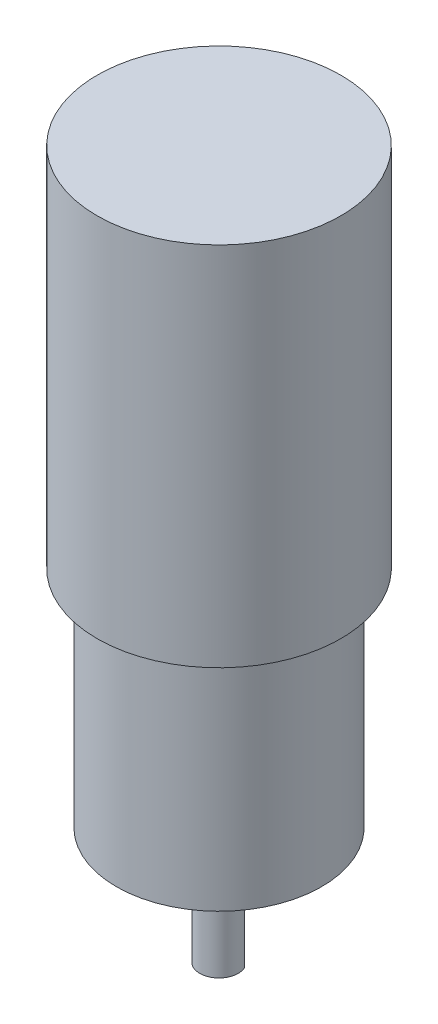
ISO-10303-21;
HEADER;
FILE_DESCRIPTION(('STEP AP214'),'2;1');
FILE_NAME('part.step','',(''),(''),'','','');
FILE_SCHEMA(('AUTOMOTIVE_DESIGN { 1 0 10303 214 1 1 1 1 }'));
ENDSEC;
DATA;
#1=APPLICATION_CONTEXT('core data for automotive mechanical design processes');
#2=APPLICATION_PROTOCOL_DEFINITION('international standard','automotive_design',2000,#1);
#3=PRODUCT_CONTEXT('',#1,'mechanical');
#4=PRODUCT('Part','Part','',(#3));
#5=PRODUCT_RELATED_PRODUCT_CATEGORY('part','',(#4));
#6=PRODUCT_DEFINITION_FORMATION('','',#4);
#7=PRODUCT_DEFINITION_CONTEXT('part definition',#1,'design');
#8=PRODUCT_DEFINITION('design','',#6,#7);
#9=PRODUCT_DEFINITION_SHAPE('','',#8);
#10=(LENGTH_UNIT() NAMED_UNIT(*) SI_UNIT(.MILLI.,.METRE.));
#11=(NAMED_UNIT(*) PLANE_ANGLE_UNIT() SI_UNIT($,.RADIAN.));
#12=(NAMED_UNIT(*) SI_UNIT($,.STERADIAN.) SOLID_ANGLE_UNIT());
#13=UNCERTAINTY_MEASURE_WITH_UNIT(LENGTH_MEASURE(1.E-05),#10,'distance_accuracy_value','');
#14=(GEOMETRIC_REPRESENTATION_CONTEXT(3) GLOBAL_UNCERTAINTY_ASSIGNED_CONTEXT((#13)) GLOBAL_UNIT_ASSIGNED_CONTEXT((#10,
#11,#12)) REPRESENTATION_CONTEXT('',''));
#15=CARTESIAN_POINT('',(0.,0.,0.));
#16=DIRECTION('',(0.,0.,1.));
#17=DIRECTION('',(1.,0.,0.));
#18=AXIS2_PLACEMENT_3D('',#15,#16,#17);
#19=CARTESIAN_POINT('',(0.,12.,-1.19895788082818));
#20=DIRECTION('',(0.,0.,-1.));
#21=DIRECTION('',(-1.,0.,0.));
#22=AXIS2_PLACEMENT_3D('',#19,#20,#21);
#23=PLANE('',#22);
#24=DIRECTION('',(1.,0.,0.));
#25=VECTOR('',#24,1.);
#26=CARTESIAN_POINT('',(0.,0.,-1.19895788082818));
#27=LINE('',#26,#25);
#28=CARTESIAN_POINT('',(-2.75,0.,-1.19895788082818));
#29=VERTEX_POINT('',#28);
#30=CARTESIAN_POINT('',(2.75,0.,-1.19895788082818));
#31=VERTEX_POINT('',#30);
#32=EDGE_CURVE('E141',#29,#31,#27,.T.);
#33=ORIENTED_EDGE('',*,*,#32,.F.);
#34=DIRECTION('',(0.,-1.,0.));
#35=VECTOR('',#34,1.);
#36=CARTESIAN_POINT('',(-2.75,12.,-1.19895788082818));
#37=LINE('',#36,#35);
#38=CARTESIAN_POINT('',(-2.75,12.,-1.19895788082818));
#39=VERTEX_POINT('',#38);
#40=EDGE_CURVE('E11',#39,#29,#37,.T.);
#41=ORIENTED_EDGE('',*,*,#40,.F.);
#42=DIRECTION('',(1.,0.,0.));
#43=VECTOR('',#42,1.);
#44=CARTESIAN_POINT('',(0.,12.,-1.19895788082818));
#45=LINE('',#44,#43);
#46=CARTESIAN_POINT('',(2.75,12.,-1.19895788082818));
#47=VERTEX_POINT('',#46);
#48=EDGE_CURVE('E66',#39,#47,#45,.T.);
#49=ORIENTED_EDGE('',*,*,#48,.T.);
#50=DIRECTION('',(0.,-1.,0.));
#51=VECTOR('',#50,1.);
#52=CARTESIAN_POINT('',(2.75,12.,-1.19895788082818));
#53=LINE('',#52,#51);
#54=EDGE_CURVE('E47',#47,#31,#53,.T.);
#55=ORIENTED_EDGE('',*,*,#54,.T.);
#56=EDGE_LOOP('',(#33,#41,#49,#55));
#57=FACE_BOUND('',#56,.T.);
#58=ADVANCED_FACE('F39',(#57),#23,.T.);
#59=CARTESIAN_POINT('',(0.,12.,0.));
#60=DIRECTION('',(0.,-1.,0.));
#61=DIRECTION('',(0.,0.,-1.));
#62=AXIS2_PLACEMENT_3D('',#59,#60,#61);
#63=CYLINDRICAL_SURFACE('',#62,3.);
#64=CARTESIAN_POINT('',(0.,0.,0.));
#65=DIRECTION('',(0.,1.,0.));
#66=DIRECTION('',(0.,0.,1.));
#67=AXIS2_PLACEMENT_3D('',#64,#65,#66);
#68=CIRCLE('',#67,3.);
#69=EDGE_CURVE('E144',#29,#31,#68,.T.);
#70=ORIENTED_EDGE('',*,*,#69,.T.);
#71=ORIENTED_EDGE('',*,*,#54,.F.);
#72=CARTESIAN_POINT('',(0.,12.,0.));
#73=DIRECTION('',(0.,1.,0.));
#74=DIRECTION('',(0.,0.,1.));
#75=AXIS2_PLACEMENT_3D('',#72,#73,#74);
#76=CIRCLE('',#75,3.);
#77=EDGE_CURVE('E53',#47,#39,#76,.T.);
#78=ORIENTED_EDGE('',*,*,#77,.T.);
#79=ORIENTED_EDGE('',*,*,#40,.T.);
#80=EDGE_LOOP('',(#70,#71,#78,#79));
#81=FACE_BOUND('',#80,.T.);
#82=CARTESIAN_POINT('',(0.,15.2,0.));
#83=DIRECTION('',(0.,1.,0.));
#84=DIRECTION('',(0.,0.,1.));
#85=AXIS2_PLACEMENT_3D('',#82,#83,#84);
#86=CIRCLE('',#85,3.);
#87=CARTESIAN_POINT('',(0.,15.2,3.));
#88=VERTEX_POINT('',#87);
#89=EDGE_CURVE('E138',#88,#88,#86,.T.);
#90=ORIENTED_EDGE('',*,*,#89,.F.);
#91=EDGE_LOOP('',(#90));
#92=FACE_BOUND('',#91,.T.);
#93=ADVANCED_FACE('F149',(#81,#92),#63,.T.);
#94=CARTESIAN_POINT('',(0.,0.,0.));
#95=DIRECTION('',(0.,1.,0.));
#96=DIRECTION('',(0.,0.,1.));
#97=AXIS2_PLACEMENT_3D('',#94,#95,#96);
#98=PLANE('',#97);
#99=ORIENTED_EDGE('',*,*,#32,.T.);
#100=ORIENTED_EDGE('',*,*,#69,.F.);
#101=EDGE_LOOP('',(#99,#100));
#102=FACE_BOUND('',#101,.T.);
#103=ADVANCED_FACE('F152',(#102),#98,.F.);
#104=CARTESIAN_POINT('',(0.,12.,0.));
#105=DIRECTION('',(0.,1.,0.));
#106=DIRECTION('',(0.,0.,1.));
#107=AXIS2_PLACEMENT_3D('',#104,#105,#106);
#108=PLANE('',#107);
#109=ORIENTED_EDGE('',*,*,#48,.F.);
#110=ORIENTED_EDGE('',*,*,#77,.F.);
#111=EDGE_LOOP('',(#109,#110));
#112=FACE_BOUND('',#111,.T.);
#113=ADVANCED_FACE('F154',(#112),#108,.F.);
#114=CARTESIAN_POINT('',(0.,18.2,0.));
#115=DIRECTION('',(0.,-1.,0.));
#116=DIRECTION('',(0.,0.,-1.));
#117=AXIS2_PLACEMENT_3D('',#114,#115,#116);
#118=CYLINDRICAL_SURFACE('',#117,10.);
#119=CARTESIAN_POINT('',(0.,15.2,0.));
#120=DIRECTION('',(0.,1.,0.));
#121=DIRECTION('',(0.,0.,1.));
#122=AXIS2_PLACEMENT_3D('',#119,#120,#121);
#123=CIRCLE('',#122,10.);
#124=CARTESIAN_POINT('',(9.,15.2,-4.35889894354067));
#125=VERTEX_POINT('',#124);
#126=CARTESIAN_POINT('',(-9.,15.2,-4.35889894354068));
#127=VERTEX_POINT('',#126);
#128=EDGE_CURVE('E125',#125,#127,#123,.T.);
#129=ORIENTED_EDGE('',*,*,#128,.T.);
#130=DIRECTION('',(0.,-1.,0.));
#131=VECTOR('',#130,1.);
#132=CARTESIAN_POINT('',(-9.,18.2,-4.35889894354068));
#133=LINE('',#132,#131);
#134=CARTESIAN_POINT('',(-9.,18.2,-4.35889894354068));
#135=VERTEX_POINT('',#134);
#136=EDGE_CURVE('E111',#135,#127,#133,.T.);
#137=ORIENTED_EDGE('',*,*,#136,.F.);
#138=CARTESIAN_POINT('',(0.,18.2,0.));
#139=DIRECTION('',(0.,1.,0.));
#140=DIRECTION('',(0.,0.,1.));
#141=AXIS2_PLACEMENT_3D('',#138,#139,#140);
#142=CIRCLE('',#141,10.);
#143=CARTESIAN_POINT('',(9.,18.2,-4.35889894354067));
#144=VERTEX_POINT('',#143);
#145=EDGE_CURVE('E106',#144,#135,#142,.T.);
#146=ORIENTED_EDGE('',*,*,#145,.F.);
#147=DIRECTION('',(0.,-1.,0.));
#148=VECTOR('',#147,1.);
#149=CARTESIAN_POINT('',(9.,18.2,-4.35889894354067));
#150=LINE('',#149,#148);
#151=EDGE_CURVE('E109',#144,#125,#150,.T.);
#152=ORIENTED_EDGE('',*,*,#151,.T.);
#153=EDGE_LOOP('',(#129,#137,#146,#152));
#154=FACE_BOUND('',#153,.T.);
#155=ADVANCED_FACE('F108',(#154),#118,.T.);
#156=CARTESIAN_POINT('',(-9.,18.2,-4.35889894354068));
#157=DIRECTION('',(1.,0.,0.));
#158=DIRECTION('',(0.,0.,-1.));
#159=AXIS2_PLACEMENT_3D('',#156,#157,#158);
#160=PLANE('',#159);
#161=DIRECTION('',(0.,0.,1.));
#162=VECTOR('',#161,1.);
#163=CARTESIAN_POINT('',(-9.,15.2,-4.35889894354068));
#164=LINE('',#163,#162);
#165=CARTESIAN_POINT('',(-9.,15.2,4.35889894354068));
#166=VERTEX_POINT('',#165);
#167=EDGE_CURVE('E127',#127,#166,#164,.T.);
#168=ORIENTED_EDGE('',*,*,#167,.T.);
#169=DIRECTION('',(0.,-1.,0.));
#170=VECTOR('',#169,1.);
#171=CARTESIAN_POINT('',(-9.,18.2,4.35889894354068));
#172=LINE('',#171,#170);
#173=CARTESIAN_POINT('',(-9.,18.2,4.35889894354068));
#174=VERTEX_POINT('',#173);
#175=EDGE_CURVE('E134',#174,#166,#172,.T.);
#176=ORIENTED_EDGE('',*,*,#175,.F.);
#177=DIRECTION('',(0.,0.,1.));
#178=VECTOR('',#177,1.);
#179=CARTESIAN_POINT('',(-9.,18.2,-4.35889894354068));
#180=LINE('',#179,#178);
#181=EDGE_CURVE('E100',#135,#174,#180,.T.);
#182=ORIENTED_EDGE('',*,*,#181,.F.);
#183=ORIENTED_EDGE('',*,*,#136,.T.);
#184=EDGE_LOOP('',(#168,#176,#182,#183));
#185=FACE_BOUND('',#184,.T.);
#186=ADVANCED_FACE('F193',(#185),#160,.F.);
#187=CARTESIAN_POINT('',(0.,18.2,0.));
#188=DIRECTION('',(0.,-1.,0.));
#189=DIRECTION('',(0.,0.,-1.));
#190=AXIS2_PLACEMENT_3D('',#187,#188,#189);
#191=CYLINDRICAL_SURFACE('',#190,10.);
#192=CARTESIAN_POINT('',(0.,15.2,0.));
#193=DIRECTION('',(0.,1.,0.));
#194=DIRECTION('',(0.,0.,1.));
#195=AXIS2_PLACEMENT_3D('',#192,#193,#194);
#196=CIRCLE('',#195,10.);
#197=CARTESIAN_POINT('',(9.,15.2,4.35889894354068));
#198=VERTEX_POINT('',#197);
#199=EDGE_CURVE('E130',#166,#198,#196,.T.);
#200=ORIENTED_EDGE('',*,*,#199,.T.);
#201=DIRECTION('',(0.,-1.,0.));
#202=VECTOR('',#201,1.);
#203=CARTESIAN_POINT('',(9.,18.2,4.35889894354068));
#204=LINE('',#203,#202);
#205=CARTESIAN_POINT('',(9.,18.2,4.35889894354068));
#206=VERTEX_POINT('',#205);
#207=EDGE_CURVE('E74',#206,#198,#204,.T.);
#208=ORIENTED_EDGE('',*,*,#207,.F.);
#209=CARTESIAN_POINT('',(0.,18.2,0.));
#210=DIRECTION('',(0.,1.,0.));
#211=DIRECTION('',(0.,0.,1.));
#212=AXIS2_PLACEMENT_3D('',#209,#210,#211);
#213=CIRCLE('',#212,10.);
#214=EDGE_CURVE('E120',#174,#206,#213,.T.);
#215=ORIENTED_EDGE('',*,*,#214,.F.);
#216=ORIENTED_EDGE('',*,*,#175,.T.);
#217=EDGE_LOOP('',(#200,#208,#215,#216));
#218=FACE_BOUND('',#217,.T.);
#219=ADVANCED_FACE('F201',(#218),#191,.T.);
#220=CARTESIAN_POINT('',(9.,18.2,-4.35889894354067));
#221=DIRECTION('',(-1.,0.,0.));
#222=DIRECTION('',(0.,0.,1.));
#223=AXIS2_PLACEMENT_3D('',#220,#221,#222);
#224=PLANE('',#223);
#225=DIRECTION('',(0.,0.,-1.));
#226=VECTOR('',#225,1.);
#227=CARTESIAN_POINT('',(9.,15.2,-4.35889894354067));
#228=LINE('',#227,#226);
#229=EDGE_CURVE('E94',#198,#125,#228,.T.);
#230=ORIENTED_EDGE('',*,*,#229,.T.);
#231=ORIENTED_EDGE('',*,*,#151,.F.);
#232=DIRECTION('',(0.,0.,-1.));
#233=VECTOR('',#232,1.);
#234=CARTESIAN_POINT('',(9.,18.2,-4.35889894354067));
#235=LINE('',#234,#233);
#236=EDGE_CURVE('E116',#206,#144,#235,.T.);
#237=ORIENTED_EDGE('',*,*,#236,.F.);
#238=ORIENTED_EDGE('',*,*,#207,.T.);
#239=EDGE_LOOP('',(#230,#231,#237,#238));
#240=FACE_BOUND('',#239,.T.);
#241=ADVANCED_FACE('F115',(#240),#224,.F.);
#242=CARTESIAN_POINT('',(0.,15.2,0.));
#243=DIRECTION('',(0.,1.,0.));
#244=DIRECTION('',(0.,0.,1.));
#245=AXIS2_PLACEMENT_3D('',#242,#243,#244);
#246=PLANE('',#245);
#247=ORIENTED_EDGE('',*,*,#89,.T.);
#248=EDGE_LOOP('',(#247));
#249=FACE_BOUND('',#248,.T.);
#250=ORIENTED_EDGE('',*,*,#128,.F.);
#251=ORIENTED_EDGE('',*,*,#229,.F.);
#252=ORIENTED_EDGE('',*,*,#199,.F.);
#253=ORIENTED_EDGE('',*,*,#167,.F.);
#254=EDGE_LOOP('',(#250,#251,#252,#253));
#255=FACE_BOUND('',#254,.T.);
#256=ADVANCED_FACE('F180',(#249,#255),#246,.F.);
#257=CARTESIAN_POINT('',(0.,18.2,0.));
#258=DIRECTION('',(0.,1.,0.));
#259=DIRECTION('',(0.,0.,1.));
#260=AXIS2_PLACEMENT_3D('',#257,#258,#259);
#261=PLANE('',#260);
#262=CARTESIAN_POINT('',(0.,18.2,13.));
#263=DIRECTION('',(0.,-1.,0.));
#264=DIRECTION('',(0.,0.,-1.));
#265=AXIS2_PLACEMENT_3D('',#262,#263,#264);
#266=CIRCLE('',#265,1.5);
#267=CARTESIAN_POINT('',(0.,18.2,11.5));
#268=VERTEX_POINT('',#267);
#269=EDGE_CURVE('E373',#268,#268,#266,.T.);
#270=ORIENTED_EDGE('',*,*,#269,.F.);
#271=EDGE_LOOP('',(#270));
#272=FACE_BOUND('',#271,.T.);
#273=CARTESIAN_POINT('',(13.,18.2,0.));
#274=DIRECTION('',(0.,-1.,0.));
#275=DIRECTION('',(0.,0.,-1.));
#276=AXIS2_PLACEMENT_3D('',#273,#274,#275);
#277=CIRCLE('',#276,1.5);
#278=CARTESIAN_POINT('',(13.,18.2,-1.50000000000005));
#279=VERTEX_POINT('',#278);
#280=EDGE_CURVE('E379',#279,#279,#277,.T.);
#281=ORIENTED_EDGE('',*,*,#280,.F.);
#282=EDGE_LOOP('',(#281));
#283=FACE_BOUND('',#282,.T.);
#284=CARTESIAN_POINT('',(0.,18.2,-13.));
#285=DIRECTION('',(0.,-1.,0.));
#286=DIRECTION('',(0.,0.,-1.));
#287=AXIS2_PLACEMENT_3D('',#284,#285,#286);
#288=CIRCLE('',#287,1.5);
#289=CARTESIAN_POINT('',(0.,18.2,-14.5));
#290=VERTEX_POINT('',#289);
#291=EDGE_CURVE('E387',#290,#290,#288,.T.);
#292=ORIENTED_EDGE('',*,*,#291,.F.);
#293=EDGE_LOOP('',(#292));
#294=FACE_BOUND('',#293,.T.);
#295=CARTESIAN_POINT('',(-13.,18.2,1.36167772214882E-13));
#296=DIRECTION('',(0.,-1.,0.));
#297=DIRECTION('',(0.,0.,-1.));
#298=AXIS2_PLACEMENT_3D('',#295,#296,#297);
#299=CIRCLE('',#298,1.5);
#300=CARTESIAN_POINT('',(-13.,18.2,-1.49999999999986));
#301=VERTEX_POINT('',#300);
#302=EDGE_CURVE('E393',#301,#301,#299,.T.);
#303=ORIENTED_EDGE('',*,*,#302,.F.);
#304=EDGE_LOOP('',(#303));
#305=FACE_BOUND('',#304,.T.);
#306=CARTESIAN_POINT('',(0.,18.2,0.));
#307=DIRECTION('',(0.,1.,0.));
#308=DIRECTION('',(0.,0.,1.));
#309=AXIS2_PLACEMENT_3D('',#306,#307,#308);
#310=CIRCLE('',#309,16.);
#311=CARTESIAN_POINT('',(0.,18.2,16.));
#312=VERTEX_POINT('',#311);
#313=EDGE_CURVE('E400',#312,#312,#310,.T.);
#314=ORIENTED_EDGE('',*,*,#313,.F.);
#315=EDGE_LOOP('',(#314));
#316=FACE_BOUND('',#315,.T.);
#317=ORIENTED_EDGE('',*,*,#236,.T.);
#318=ORIENTED_EDGE('',*,*,#145,.T.);
#319=ORIENTED_EDGE('',*,*,#181,.T.);
#320=ORIENTED_EDGE('',*,*,#214,.T.);
#321=EDGE_LOOP('',(#317,#318,#319,#320));
#322=FACE_BOUND('',#321,.T.);
#323=ADVANCED_FACE('F119',(#272,#283,#294,#305,#316,#322),#261,.F.);
#324=CARTESIAN_POINT('',(0.,53.2,0.));
#325=DIRECTION('',(0.,-1.,0.));
#326=DIRECTION('',(0.,0.,-1.));
#327=AXIS2_PLACEMENT_3D('',#324,#325,#326);
#328=CYLINDRICAL_SURFACE('',#327,16.);
#329=CARTESIAN_POINT('',(0.,53.2,0.));
#330=DIRECTION('',(0.,1.,0.));
#331=DIRECTION('',(0.,0.,1.));
#332=AXIS2_PLACEMENT_3D('',#329,#330,#331);
#333=CIRCLE('',#332,16.);
#334=CARTESIAN_POINT('',(0.,53.2,16.));
#335=VERTEX_POINT('',#334);
#336=EDGE_CURVE('E128',#335,#335,#333,.T.);
#337=ORIENTED_EDGE('',*,*,#336,.F.);
#338=EDGE_LOOP('',(#337));
#339=FACE_BOUND('',#338,.T.);
#340=ORIENTED_EDGE('',*,*,#313,.T.);
#341=EDGE_LOOP('',(#340));
#342=FACE_BOUND('',#341,.T.);
#343=ADVANCED_FACE('F219',(#339,#342),#328,.T.);
#344=CARTESIAN_POINT('',(0.,110.3,0.));
#345=DIRECTION('',(0.,-1.,0.));
#346=DIRECTION('',(0.,0.,-1.));
#347=AXIS2_PLACEMENT_3D('',#344,#345,#346);
#348=CYLINDRICAL_SURFACE('',#347,19.);
#349=CARTESIAN_POINT('',(0.,110.3,0.));
#350=DIRECTION('',(0.,1.,0.));
#351=DIRECTION('',(0.,0.,1.));
#352=AXIS2_PLACEMENT_3D('',#349,#350,#351);
#353=CIRCLE('',#352,19.);
#354=CARTESIAN_POINT('',(0.,110.3,19.));
#355=VERTEX_POINT('',#354);
#356=EDGE_CURVE('E376',#355,#355,#353,.T.);
#357=ORIENTED_EDGE('',*,*,#356,.F.);
#358=EDGE_LOOP('',(#357));
#359=FACE_BOUND('',#358,.T.);
#360=CARTESIAN_POINT('',(0.,53.2,0.));
#361=DIRECTION('',(0.,1.,0.));
#362=DIRECTION('',(0.,0.,1.));
#363=AXIS2_PLACEMENT_3D('',#360,#361,#362);
#364=CIRCLE('',#363,19.);
#365=CARTESIAN_POINT('',(0.,53.2,19.));
#366=VERTEX_POINT('',#365);
#367=EDGE_CURVE('E372',#366,#366,#364,.T.);
#368=ORIENTED_EDGE('',*,*,#367,.T.);
#369=EDGE_LOOP('',(#368));
#370=FACE_BOUND('',#369,.T.);
#371=ADVANCED_FACE('F223',(#359,#370),#348,.T.);
#372=CARTESIAN_POINT('',(0.,110.3,0.));
#373=DIRECTION('',(0.,1.,0.));
#374=DIRECTION('',(0.,0.,1.));
#375=AXIS2_PLACEMENT_3D('',#372,#373,#374);
#376=PLANE('',#375);
#377=ORIENTED_EDGE('',*,*,#356,.T.);
#378=EDGE_LOOP('',(#377));
#379=FACE_BOUND('',#378,.T.);
#380=ADVANCED_FACE('F232',(#379),#376,.T.);
#381=CARTESIAN_POINT('',(0.,53.2,0.));
#382=DIRECTION('',(0.,1.,0.));
#383=DIRECTION('',(0.,0.,1.));
#384=AXIS2_PLACEMENT_3D('',#381,#382,#383);
#385=PLANE('',#384);
#386=ORIENTED_EDGE('',*,*,#336,.T.);
#387=EDGE_LOOP('',(#386));
#388=FACE_BOUND('',#387,.T.);
#389=ORIENTED_EDGE('',*,*,#367,.F.);
#390=EDGE_LOOP('',(#389));
#391=FACE_BOUND('',#390,.T.);
#392=ADVANCED_FACE('F241',(#388,#391),#385,.F.);
#393=CARTESIAN_POINT('',(-13.,28.2,1.36167772214882E-13));
#394=DIRECTION('',(0.,-1.,0.));
#395=DIRECTION('',(0.,0.,-1.));
#396=AXIS2_PLACEMENT_3D('',#393,#394,#395);
#397=CYLINDRICAL_SURFACE('',#396,1.5);
#398=CARTESIAN_POINT('',(-13.,28.2,1.36167772214882E-13));
#399=DIRECTION('',(0.,-1.,0.));
#400=DIRECTION('',(0.,0.,-1.));
#401=AXIS2_PLACEMENT_3D('',#398,#399,#400);
#402=CIRCLE('',#401,1.5);
#403=CARTESIAN_POINT('',(-13.,28.2,-1.49999999999986));
#404=VERTEX_POINT('',#403);
#405=EDGE_CURVE('E396',#404,#404,#402,.T.);
#406=ORIENTED_EDGE('',*,*,#405,.F.);
#407=EDGE_LOOP('',(#406));
#408=FACE_BOUND('',#407,.T.);
#409=ORIENTED_EDGE('',*,*,#302,.T.);
#410=EDGE_LOOP('',(#409));
#411=FACE_BOUND('',#410,.T.);
#412=ADVANCED_FACE('F250',(#408,#411),#397,.F.);
#413=CARTESIAN_POINT('',(-13.,28.2,1.36167772214882E-13));
#414=DIRECTION('',(0.,-1.,0.));
#415=DIRECTION('',(0.,0.,-1.));
#416=AXIS2_PLACEMENT_3D('',#413,#414,#415);
#417=PLANE('',#416);
#418=ORIENTED_EDGE('',*,*,#405,.T.);
#419=EDGE_LOOP('',(#418));
#420=FACE_BOUND('',#419,.T.);
#421=ADVANCED_FACE('F266',(#420),#417,.T.);
#422=CARTESIAN_POINT('',(0.,28.2,-13.));
#423=DIRECTION('',(0.,-1.,0.));
#424=DIRECTION('',(0.,0.,-1.));
#425=AXIS2_PLACEMENT_3D('',#422,#423,#424);
#426=CYLINDRICAL_SURFACE('',#425,1.5);
#427=CARTESIAN_POINT('',(0.,28.2,-13.));
#428=DIRECTION('',(0.,-1.,0.));
#429=DIRECTION('',(0.,0.,-1.));
#430=AXIS2_PLACEMENT_3D('',#427,#428,#429);
#431=CIRCLE('',#430,1.5);
#432=CARTESIAN_POINT('',(0.,28.2,-14.5));
#433=VERTEX_POINT('',#432);
#434=EDGE_CURVE('E390',#433,#433,#431,.T.);
#435=ORIENTED_EDGE('',*,*,#434,.F.);
#436=EDGE_LOOP('',(#435));
#437=FACE_BOUND('',#436,.T.);
#438=ORIENTED_EDGE('',*,*,#291,.T.);
#439=EDGE_LOOP('',(#438));
#440=FACE_BOUND('',#439,.T.);
#441=ADVANCED_FACE('F275',(#437,#440),#426,.F.);
#442=CARTESIAN_POINT('',(0.,28.2,-13.));
#443=DIRECTION('',(0.,-1.,0.));
#444=DIRECTION('',(0.,0.,-1.));
#445=AXIS2_PLACEMENT_3D('',#442,#443,#444);
#446=PLANE('',#445);
#447=ORIENTED_EDGE('',*,*,#434,.T.);
#448=EDGE_LOOP('',(#447));
#449=FACE_BOUND('',#448,.T.);
#450=ADVANCED_FACE('F284',(#449),#446,.T.);
#451=CARTESIAN_POINT('',(13.,28.2,0.));
#452=DIRECTION('',(0.,-1.,0.));
#453=DIRECTION('',(0.,0.,-1.));
#454=AXIS2_PLACEMENT_3D('',#451,#452,#453);
#455=CYLINDRICAL_SURFACE('',#454,1.5);
#456=CARTESIAN_POINT('',(13.,28.2,0.));
#457=DIRECTION('',(0.,-1.,0.));
#458=DIRECTION('',(0.,0.,-1.));
#459=AXIS2_PLACEMENT_3D('',#456,#457,#458);
#460=CIRCLE('',#459,1.5);
#461=CARTESIAN_POINT('',(13.,28.2,-1.50000000000005));
#462=VERTEX_POINT('',#461);
#463=EDGE_CURVE('E384',#462,#462,#460,.T.);
#464=ORIENTED_EDGE('',*,*,#463,.F.);
#465=EDGE_LOOP('',(#464));
#466=FACE_BOUND('',#465,.T.);
#467=ORIENTED_EDGE('',*,*,#280,.T.);
#468=EDGE_LOOP('',(#467));
#469=FACE_BOUND('',#468,.T.);
#470=ADVANCED_FACE('F293',(#466,#469),#455,.F.);
#471=CARTESIAN_POINT('',(13.,28.2,0.));
#472=DIRECTION('',(0.,-1.,0.));
#473=DIRECTION('',(0.,0.,-1.));
#474=AXIS2_PLACEMENT_3D('',#471,#472,#473);
#475=PLANE('',#474);
#476=ORIENTED_EDGE('',*,*,#463,.T.);
#477=EDGE_LOOP('',(#476));
#478=FACE_BOUND('',#477,.T.);
#479=ADVANCED_FACE('F302',(#478),#475,.T.);
#480=CARTESIAN_POINT('',(0.,28.2,13.));
#481=DIRECTION('',(0.,-1.,0.));
#482=DIRECTION('',(0.,0.,-1.));
#483=AXIS2_PLACEMENT_3D('',#480,#481,#482);
#484=CYLINDRICAL_SURFACE('',#483,1.5);
#485=CARTESIAN_POINT('',(0.,28.2,13.));
#486=DIRECTION('',(0.,-1.,0.));
#487=DIRECTION('',(0.,0.,-1.));
#488=AXIS2_PLACEMENT_3D('',#485,#486,#487);
#489=CIRCLE('',#488,1.5);
#490=CARTESIAN_POINT('',(0.,28.2,11.5));
#491=VERTEX_POINT('',#490);
#492=EDGE_CURVE('E371',#491,#491,#489,.T.);
#493=ORIENTED_EDGE('',*,*,#492,.F.);
#494=EDGE_LOOP('',(#493));
#495=FACE_BOUND('',#494,.T.);
#496=ORIENTED_EDGE('',*,*,#269,.T.);
#497=EDGE_LOOP('',(#496));
#498=FACE_BOUND('',#497,.T.);
#499=ADVANCED_FACE('F311',(#495,#498),#484,.F.);
#500=CARTESIAN_POINT('',(0.,28.2,13.));
#501=DIRECTION('',(0.,-1.,0.));
#502=DIRECTION('',(0.,0.,-1.));
#503=AXIS2_PLACEMENT_3D('',#500,#501,#502);
#504=PLANE('',#503);
#505=ORIENTED_EDGE('',*,*,#492,.T.);
#506=EDGE_LOOP('',(#505));
#507=FACE_BOUND('',#506,.T.);
#508=ADVANCED_FACE('F320',(#507),#504,.T.);
#509=CLOSED_SHELL('',(#58,#93,#103,#113,#155,#186,#219,#241,#256,#323,#343,#371,#380,#392,#412,
#421,#441,#450,#470,#479,#499,#508));
#510=MANIFOLD_SOLID_BREP('B2',#509);
#511=ADVANCED_BREP_SHAPE_REPRESENTATION('',(#18,#510),#14);
#512=SHAPE_DEFINITION_REPRESENTATION(#9,#511);
ENDSEC;
END-ISO-10303-21;
